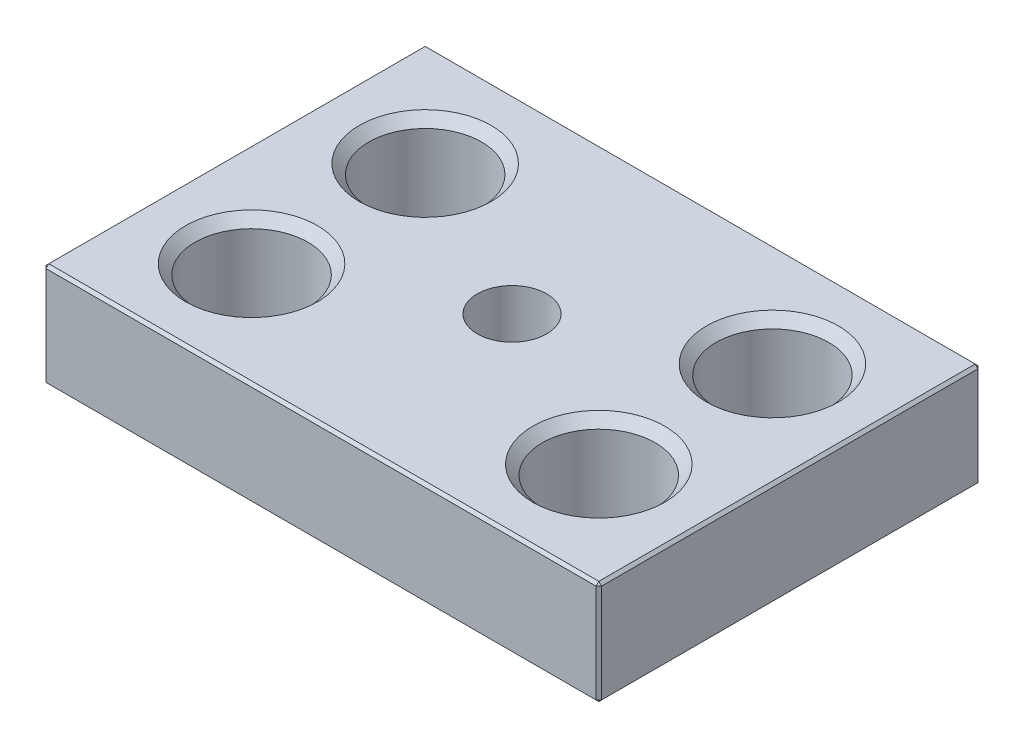
ISO-10303-21;
HEADER;
FILE_DESCRIPTION(('STEP AP214'),'2;1');
FILE_NAME('part.step','',(''),(''),'','','');
FILE_SCHEMA(('AUTOMOTIVE_DESIGN { 1 0 10303 214 1 1 1 1 }'));
ENDSEC;
DATA;
#1=APPLICATION_CONTEXT('core data for automotive mechanical design processes');
#2=APPLICATION_PROTOCOL_DEFINITION('international standard','automotive_design',2000,#1);
#3=PRODUCT_CONTEXT('',#1,'mechanical');
#4=PRODUCT('Part','Part','',(#3));
#5=PRODUCT_RELATED_PRODUCT_CATEGORY('part','',(#4));
#6=PRODUCT_DEFINITION_FORMATION('','',#4);
#7=PRODUCT_DEFINITION_CONTEXT('part definition',#1,'design');
#8=PRODUCT_DEFINITION('design','',#6,#7);
#9=PRODUCT_DEFINITION_SHAPE('','',#8);
#10=(LENGTH_UNIT() NAMED_UNIT(*) SI_UNIT(.MILLI.,.METRE.));
#11=(NAMED_UNIT(*) PLANE_ANGLE_UNIT() SI_UNIT($,.RADIAN.));
#12=(NAMED_UNIT(*) SI_UNIT($,.STERADIAN.) SOLID_ANGLE_UNIT());
#13=UNCERTAINTY_MEASURE_WITH_UNIT(LENGTH_MEASURE(1.E-05),#10,'distance_accuracy_value','');
#14=(GEOMETRIC_REPRESENTATION_CONTEXT(3) GLOBAL_UNCERTAINTY_ASSIGNED_CONTEXT((#13)) GLOBAL_UNIT_ASSIGNED_CONTEXT((#10,
#11,#12)) REPRESENTATION_CONTEXT('',''));
#15=CARTESIAN_POINT('',(0.,0.,0.));
#16=DIRECTION('',(0.,0.,1.));
#17=DIRECTION('',(1.,0.,0.));
#18=AXIS2_PLACEMENT_3D('',#15,#16,#17);
#19=CARTESIAN_POINT('',(-50.8,19.05,-34.925));
#20=DIRECTION('',(1.,0.,0.));
#21=DIRECTION('',(0.,0.,-1.));
#22=AXIS2_PLACEMENT_3D('',#19,#20,#21);
#23=PLANE('',#22);
#24=DIRECTION('',(0.,0.,1.));
#25=VECTOR('',#24,1.);
#26=CARTESIAN_POINT('',(-50.8,0.508000000000008,-34.925));
#27=LINE('',#26,#25);
#28=CARTESIAN_POINT('',(-50.8,0.508000000000008,-34.417));
#29=VERTEX_POINT('',#28);
#30=CARTESIAN_POINT('',(-50.8,0.508000000000008,34.417));
#31=VERTEX_POINT('',#30);
#32=EDGE_CURVE('E275',#29,#31,#27,.T.);
#33=ORIENTED_EDGE('',*,*,#32,.T.);
#34=DIRECTION('',(0.,1.,0.));
#35=VECTOR('',#34,1.);
#36=CARTESIAN_POINT('',(-50.8,19.05,34.417));
#37=LINE('',#36,#35);
#38=CARTESIAN_POINT('',(-50.8,18.542,34.417));
#39=VERTEX_POINT('',#38);
#40=EDGE_CURVE('E277',#31,#39,#37,.T.);
#41=ORIENTED_EDGE('',*,*,#40,.T.);
#42=DIRECTION('',(0.,0.,-1.));
#43=VECTOR('',#42,1.);
#44=CARTESIAN_POINT('',(-50.8,18.542,-34.925));
#45=LINE('',#44,#43);
#46=CARTESIAN_POINT('',(-50.8,18.542,-34.417));
#47=VERTEX_POINT('',#46);
#48=EDGE_CURVE('E271',#39,#47,#45,.T.);
#49=ORIENTED_EDGE('',*,*,#48,.T.);
#50=DIRECTION('',(0.,-1.,0.));
#51=VECTOR('',#50,1.);
#52=CARTESIAN_POINT('',(-50.8,19.05,-34.417));
#53=LINE('',#52,#51);
#54=EDGE_CURVE('E273',#47,#29,#53,.T.);
#55=ORIENTED_EDGE('',*,*,#54,.T.);
#56=EDGE_LOOP('',(#33,#41,#49,#55));
#57=FACE_BOUND('',#56,.T.);
#58=ADVANCED_FACE('F34',(#57),#23,.F.);
#59=CARTESIAN_POINT('',(-50.8,19.05,34.925));
#60=DIRECTION('',(0.,0.,-1.));
#61=DIRECTION('',(-1.,0.,0.));
#62=AXIS2_PLACEMENT_3D('',#59,#60,#61);
#63=PLANE('',#62);
#64=DIRECTION('',(-1.,0.,0.));
#65=VECTOR('',#64,1.);
#66=CARTESIAN_POINT('',(-50.8,18.542,34.925));
#67=LINE('',#66,#65);
#68=CARTESIAN_POINT('',(50.292,18.542,34.925));
#69=VERTEX_POINT('',#68);
#70=CARTESIAN_POINT('',(-50.292,18.542,34.925));
#71=VERTEX_POINT('',#70);
#72=EDGE_CURVE('E133',#69,#71,#67,.T.);
#73=ORIENTED_EDGE('',*,*,#72,.T.);
#74=DIRECTION('',(0.,-1.,0.));
#75=VECTOR('',#74,1.);
#76=CARTESIAN_POINT('',(-50.292,19.05,34.925));
#77=LINE('',#76,#75);
#78=CARTESIAN_POINT('',(-50.292,0.508000000000008,34.925));
#79=VERTEX_POINT('',#78);
#80=EDGE_CURVE('E129',#71,#79,#77,.T.);
#81=ORIENTED_EDGE('',*,*,#80,.T.);
#82=DIRECTION('',(1.,0.,0.));
#83=VECTOR('',#82,1.);
#84=CARTESIAN_POINT('',(-50.8,0.508000000000008,34.925));
#85=LINE('',#84,#83);
#86=CARTESIAN_POINT('',(50.292,0.508000000000008,34.925));
#87=VERTEX_POINT('',#86);
#88=EDGE_CURVE('E123',#79,#87,#85,.T.);
#89=ORIENTED_EDGE('',*,*,#88,.T.);
#90=DIRECTION('',(0.,1.,0.));
#91=VECTOR('',#90,1.);
#92=CARTESIAN_POINT('',(50.292,19.05,34.925));
#93=LINE('',#92,#91);
#94=EDGE_CURVE('E126',#87,#69,#93,.T.);
#95=ORIENTED_EDGE('',*,*,#94,.T.);
#96=EDGE_LOOP('',(#73,#81,#89,#95));
#97=FACE_BOUND('',#96,.T.);
#98=ADVANCED_FACE('F125',(#97),#63,.F.);
#99=CARTESIAN_POINT('',(50.8,19.05,-34.925));
#100=DIRECTION('',(-1.,0.,0.));
#101=DIRECTION('',(0.,0.,1.));
#102=AXIS2_PLACEMENT_3D('',#99,#100,#101);
#103=PLANE('',#102);
#104=DIRECTION('',(0.,0.,1.));
#105=VECTOR('',#104,1.);
#106=CARTESIAN_POINT('',(50.8,18.542,34.925));
#107=LINE('',#106,#105);
#108=CARTESIAN_POINT('',(50.8,18.542,-34.417));
#109=VERTEX_POINT('',#108);
#110=CARTESIAN_POINT('',(50.8,18.542,34.417));
#111=VERTEX_POINT('',#110);
#112=EDGE_CURVE('E43',#109,#111,#107,.T.);
#113=ORIENTED_EDGE('',*,*,#112,.T.);
#114=DIRECTION('',(0.,-1.,0.));
#115=VECTOR('',#114,1.);
#116=CARTESIAN_POINT('',(50.8,19.05,34.417));
#117=LINE('',#116,#115);
#118=CARTESIAN_POINT('',(50.8,0.508000000000008,34.417));
#119=VERTEX_POINT('',#118);
#120=EDGE_CURVE('E11',#111,#119,#117,.T.);
#121=ORIENTED_EDGE('',*,*,#120,.T.);
#122=DIRECTION('',(0.,0.,-1.));
#123=VECTOR('',#122,1.);
#124=CARTESIAN_POINT('',(50.8,0.508000000000008,-34.925));
#125=LINE('',#124,#123);
#126=CARTESIAN_POINT('',(50.8,0.508000000000008,-34.417));
#127=VERTEX_POINT('',#126);
#128=EDGE_CURVE('E305',#119,#127,#125,.T.);
#129=ORIENTED_EDGE('',*,*,#128,.T.);
#130=DIRECTION('',(0.,1.,0.));
#131=VECTOR('',#130,1.);
#132=CARTESIAN_POINT('',(50.8,19.05,-34.417));
#133=LINE('',#132,#131);
#134=EDGE_CURVE('E54',#127,#109,#133,.T.);
#135=ORIENTED_EDGE('',*,*,#134,.T.);
#136=EDGE_LOOP('',(#113,#121,#129,#135));
#137=FACE_BOUND('',#136,.T.);
#138=ADVANCED_FACE('F352',(#137),#103,.F.);
#139=CARTESIAN_POINT('',(-50.8,19.05,-34.925));
#140=DIRECTION('',(0.,0.,1.));
#141=DIRECTION('',(1.,0.,0.));
#142=AXIS2_PLACEMENT_3D('',#139,#140,#141);
#143=PLANE('',#142);
#144=DIRECTION('',(-1.,0.,0.));
#145=VECTOR('',#144,1.);
#146=CARTESIAN_POINT('',(-50.8,0.508000000000008,-34.925));
#147=LINE('',#146,#145);
#148=CARTESIAN_POINT('',(50.292,0.508000000000008,-34.925));
#149=VERTEX_POINT('',#148);
#150=CARTESIAN_POINT('',(-50.292,0.508000000000008,-34.925));
#151=VERTEX_POINT('',#150);
#152=EDGE_CURVE('E287',#149,#151,#147,.T.);
#153=ORIENTED_EDGE('',*,*,#152,.T.);
#154=DIRECTION('',(0.,1.,0.));
#155=VECTOR('',#154,1.);
#156=CARTESIAN_POINT('',(-50.292,19.05,-34.925));
#157=LINE('',#156,#155);
#158=CARTESIAN_POINT('',(-50.292,18.542,-34.925));
#159=VERTEX_POINT('',#158);
#160=EDGE_CURVE('E293',#151,#159,#157,.T.);
#161=ORIENTED_EDGE('',*,*,#160,.T.);
#162=DIRECTION('',(1.,0.,0.));
#163=VECTOR('',#162,1.);
#164=CARTESIAN_POINT('',(50.8,18.542,-34.925));
#165=LINE('',#164,#163);
#166=CARTESIAN_POINT('',(50.292,18.542,-34.925));
#167=VERTEX_POINT('',#166);
#168=EDGE_CURVE('E291',#159,#167,#165,.T.);
#169=ORIENTED_EDGE('',*,*,#168,.T.);
#170=DIRECTION('',(0.,-1.,0.));
#171=VECTOR('',#170,1.);
#172=CARTESIAN_POINT('',(50.292,19.05,-34.925));
#173=LINE('',#172,#171);
#174=EDGE_CURVE('E289',#167,#149,#173,.T.);
#175=ORIENTED_EDGE('',*,*,#174,.T.);
#176=EDGE_LOOP('',(#153,#161,#169,#175));
#177=FACE_BOUND('',#176,.T.);
#178=ADVANCED_FACE('F697',(#177),#143,.F.);
#179=CARTESIAN_POINT('',(-50.8,19.05,34.925));
#180=DIRECTION('',(0.,1.,0.));
#181=DIRECTION('',(0.,0.,1.));
#182=AXIS2_PLACEMENT_3D('',#179,#180,#181);
#183=PLANE('',#182);
#184=DIRECTION('',(-1.,0.,0.));
#185=VECTOR('',#184,1.);
#186=CARTESIAN_POINT('',(-50.8,19.05,-34.417));
#187=LINE('',#186,#185);
#188=CARTESIAN_POINT('',(50.292,19.05,-34.417));
#189=VERTEX_POINT('',#188);
#190=CARTESIAN_POINT('',(-50.292,19.05,-34.417));
#191=VERTEX_POINT('',#190);
#192=EDGE_CURVE('E298',#189,#191,#187,.T.);
#193=ORIENTED_EDGE('',*,*,#192,.T.);
#194=DIRECTION('',(0.,0.,1.));
#195=VECTOR('',#194,1.);
#196=CARTESIAN_POINT('',(-50.292,19.05,34.925));
#197=LINE('',#196,#195);
#198=CARTESIAN_POINT('',(-50.292,19.05,34.417));
#199=VERTEX_POINT('',#198);
#200=EDGE_CURVE('E302',#191,#199,#197,.T.);
#201=ORIENTED_EDGE('',*,*,#200,.T.);
#202=DIRECTION('',(1.,0.,0.));
#203=VECTOR('',#202,1.);
#204=CARTESIAN_POINT('',(50.8,19.05,34.417));
#205=LINE('',#204,#203);
#206=CARTESIAN_POINT('',(50.292,19.05,34.417));
#207=VERTEX_POINT('',#206);
#208=EDGE_CURVE('E300',#199,#207,#205,.T.);
#209=ORIENTED_EDGE('',*,*,#208,.T.);
#210=DIRECTION('',(0.,0.,-1.));
#211=VECTOR('',#210,1.);
#212=CARTESIAN_POINT('',(50.292,19.05,-34.925));
#213=LINE('',#212,#211);
#214=EDGE_CURVE('E296',#207,#189,#213,.T.);
#215=ORIENTED_EDGE('',*,*,#214,.T.);
#216=EDGE_LOOP('',(#193,#201,#209,#215));
#217=FACE_BOUND('',#216,.T.);
#218=CARTESIAN_POINT('',(0.,19.05,0.));
#219=DIRECTION('',(0.,1.,0.));
#220=DIRECTION('',(0.,0.,1.));
#221=AXIS2_PLACEMENT_3D('',#218,#219,#220);
#222=CIRCLE('',#221,6.35);
#223=CARTESIAN_POINT('',(0.,19.05,6.35));
#224=VERTEX_POINT('',#223);
#225=EDGE_CURVE('E204',#224,#224,#222,.T.);
#226=ORIENTED_EDGE('',*,*,#225,.F.);
#227=EDGE_LOOP('',(#226));
#228=FACE_BOUND('',#227,.T.);
#229=CARTESIAN_POINT('',(31.75,19.05,15.875));
#230=DIRECTION('',(0.,1.,0.));
#231=DIRECTION('',(0.,0.,1.));
#232=AXIS2_PLACEMENT_3D('',#229,#230,#231);
#233=CIRCLE('',#232,12.065);
#234=CARTESIAN_POINT('',(31.75,19.05,27.94));
#235=VERTEX_POINT('',#234);
#236=EDGE_CURVE('E222',#235,#235,#233,.T.);
#237=ORIENTED_EDGE('',*,*,#236,.F.);
#238=EDGE_LOOP('',(#237));
#239=FACE_BOUND('',#238,.T.);
#240=CARTESIAN_POINT('',(31.75,19.05,-15.875));
#241=DIRECTION('',(0.,1.,0.));
#242=DIRECTION('',(0.,0.,1.));
#243=AXIS2_PLACEMENT_3D('',#240,#241,#242);
#244=CIRCLE('',#243,12.065);
#245=CARTESIAN_POINT('',(31.75,19.05,-3.81));
#246=VERTEX_POINT('',#245);
#247=EDGE_CURVE('E234',#246,#246,#244,.T.);
#248=ORIENTED_EDGE('',*,*,#247,.F.);
#249=EDGE_LOOP('',(#248));
#250=FACE_BOUND('',#249,.T.);
#251=CARTESIAN_POINT('',(-31.75,19.05,-15.875));
#252=DIRECTION('',(0.,1.,0.));
#253=DIRECTION('',(0.,0.,1.));
#254=AXIS2_PLACEMENT_3D('',#251,#252,#253);
#255=CIRCLE('',#254,12.065);
#256=CARTESIAN_POINT('',(-31.75,19.05,-3.81));
#257=VERTEX_POINT('',#256);
#258=EDGE_CURVE('E246',#257,#257,#255,.T.);
#259=ORIENTED_EDGE('',*,*,#258,.F.);
#260=EDGE_LOOP('',(#259));
#261=FACE_BOUND('',#260,.T.);
#262=CARTESIAN_POINT('',(-31.75,19.05,15.875));
#263=DIRECTION('',(0.,1.,0.));
#264=DIRECTION('',(0.,0.,1.));
#265=AXIS2_PLACEMENT_3D('',#262,#263,#264);
#266=CIRCLE('',#265,12.065);
#267=CARTESIAN_POINT('',(-31.75,19.05,27.94));
#268=VERTEX_POINT('',#267);
#269=EDGE_CURVE('E258',#268,#268,#266,.T.);
#270=ORIENTED_EDGE('',*,*,#269,.F.);
#271=EDGE_LOOP('',(#270));
#272=FACE_BOUND('',#271,.T.);
#273=ADVANCED_FACE('F363',(#217,#228,#239,#250,#261,#272),#183,.T.);
#274=CARTESIAN_POINT('',(-50.8,0.,34.925));
#275=DIRECTION('',(0.,1.,0.));
#276=DIRECTION('',(0.,0.,1.));
#277=AXIS2_PLACEMENT_3D('',#274,#275,#276);
#278=PLANE('',#277);
#279=DIRECTION('',(0.,0.,1.));
#280=VECTOR('',#279,1.);
#281=CARTESIAN_POINT('',(50.292,0.,34.925));
#282=LINE('',#281,#280);
#283=CARTESIAN_POINT('',(50.292,0.,-34.417));
#284=VERTEX_POINT('',#283);
#285=CARTESIAN_POINT('',(50.292,0.,34.417));
#286=VERTEX_POINT('',#285);
#287=EDGE_CURVE('E282',#284,#286,#282,.T.);
#288=ORIENTED_EDGE('',*,*,#287,.T.);
#289=DIRECTION('',(-1.,0.,0.));
#290=VECTOR('',#289,1.);
#291=CARTESIAN_POINT('',(-50.8,0.,34.417));
#292=LINE('',#291,#290);
#293=CARTESIAN_POINT('',(-50.292,0.,34.417));
#294=VERTEX_POINT('',#293);
#295=EDGE_CURVE('E156',#286,#294,#292,.T.);
#296=ORIENTED_EDGE('',*,*,#295,.T.);
#297=DIRECTION('',(0.,0.,-1.));
#298=VECTOR('',#297,1.);
#299=CARTESIAN_POINT('',(-50.292,0.,34.925));
#300=LINE('',#299,#298);
#301=CARTESIAN_POINT('',(-50.292,0.,-34.417));
#302=VERTEX_POINT('',#301);
#303=EDGE_CURVE('E284',#294,#302,#300,.T.);
#304=ORIENTED_EDGE('',*,*,#303,.T.);
#305=DIRECTION('',(1.,0.,0.));
#306=VECTOR('',#305,1.);
#307=CARTESIAN_POINT('',(-50.8,0.,-34.417));
#308=LINE('',#307,#306);
#309=EDGE_CURVE('E280',#302,#284,#308,.T.);
#310=ORIENTED_EDGE('',*,*,#309,.T.);
#311=EDGE_LOOP('',(#288,#296,#304,#310));
#312=FACE_BOUND('',#311,.T.);
#313=CARTESIAN_POINT('',(0.,0.,0.));
#314=DIRECTION('',(0.,1.,0.));
#315=DIRECTION('',(0.,0.,1.));
#316=AXIS2_PLACEMENT_3D('',#313,#314,#315);
#317=CIRCLE('',#316,2.8067);
#318=CARTESIAN_POINT('',(0.,0.,2.8067));
#319=VERTEX_POINT('',#318);
#320=EDGE_CURVE('E219',#319,#319,#317,.T.);
#321=ORIENTED_EDGE('',*,*,#320,.T.);
#322=EDGE_LOOP('',(#321));
#323=FACE_BOUND('',#322,.T.);
#324=CARTESIAN_POINT('',(31.75,0.,15.875));
#325=DIRECTION('',(0.,1.,0.));
#326=DIRECTION('',(0.,0.,1.));
#327=AXIS2_PLACEMENT_3D('',#324,#325,#326);
#328=CIRCLE('',#327,12.065);
#329=CARTESIAN_POINT('',(31.75,0.,27.94));
#330=VERTEX_POINT('',#329);
#331=EDGE_CURVE('E231',#330,#330,#328,.T.);
#332=ORIENTED_EDGE('',*,*,#331,.T.);
#333=EDGE_LOOP('',(#332));
#334=FACE_BOUND('',#333,.T.);
#335=CARTESIAN_POINT('',(31.75,0.,-15.875));
#336=DIRECTION('',(0.,1.,0.));
#337=DIRECTION('',(0.,0.,1.));
#338=AXIS2_PLACEMENT_3D('',#335,#336,#337);
#339=CIRCLE('',#338,12.065);
#340=CARTESIAN_POINT('',(31.75,0.,-3.81000000000001));
#341=VERTEX_POINT('',#340);
#342=EDGE_CURVE('E243',#341,#341,#339,.T.);
#343=ORIENTED_EDGE('',*,*,#342,.T.);
#344=EDGE_LOOP('',(#343));
#345=FACE_BOUND('',#344,.T.);
#346=CARTESIAN_POINT('',(-31.75,0.,-15.875));
#347=DIRECTION('',(0.,1.,0.));
#348=DIRECTION('',(0.,0.,1.));
#349=AXIS2_PLACEMENT_3D('',#346,#347,#348);
#350=CIRCLE('',#349,12.065);
#351=CARTESIAN_POINT('',(-31.75,0.,-3.81000000000001));
#352=VERTEX_POINT('',#351);
#353=EDGE_CURVE('E255',#352,#352,#350,.T.);
#354=ORIENTED_EDGE('',*,*,#353,.T.);
#355=EDGE_LOOP('',(#354));
#356=FACE_BOUND('',#355,.T.);
#357=CARTESIAN_POINT('',(-31.75,0.,15.875));
#358=DIRECTION('',(0.,1.,0.));
#359=DIRECTION('',(0.,0.,1.));
#360=AXIS2_PLACEMENT_3D('',#357,#358,#359);
#361=CIRCLE('',#360,12.065);
#362=CARTESIAN_POINT('',(-31.75,0.,27.94));
#363=VERTEX_POINT('',#362);
#364=EDGE_CURVE('E144',#363,#363,#361,.T.);
#365=ORIENTED_EDGE('',*,*,#364,.T.);
#366=EDGE_LOOP('',(#365));
#367=FACE_BOUND('',#366,.T.);
#368=ADVANCED_FACE('F347',(#312,#323,#334,#345,#356,#367),#278,.F.);
#369=CARTESIAN_POINT('',(-31.75,1.74625,15.875));
#370=DIRECTION('',(0.,-1.,0.));
#371=DIRECTION('',(0.,0.,-1.));
#372=AXIS2_PLACEMENT_3D('',#369,#370,#371);
#373=CONICAL_SURFACE('',#372,10.31875,0.785398163397447);
#374=ORIENTED_EDGE('',*,*,#364,.F.);
#375=EDGE_LOOP('',(#374));
#376=FACE_BOUND('',#375,.T.);
#377=CARTESIAN_POINT('',(-31.75,1.74625,15.875));
#378=DIRECTION('',(0.,1.,0.));
#379=DIRECTION('',(0.,0.,1.));
#380=AXIS2_PLACEMENT_3D('',#377,#378,#379);
#381=CIRCLE('',#380,10.31875);
#382=CARTESIAN_POINT('',(-31.75,1.74625,26.19375));
#383=VERTEX_POINT('',#382);
#384=EDGE_CURVE('E264',#383,#383,#381,.T.);
#385=ORIENTED_EDGE('',*,*,#384,.T.);
#386=EDGE_LOOP('',(#385));
#387=FACE_BOUND('',#386,.T.);
#388=ADVANCED_FACE('F673',(#376,#387),#373,.F.);
#389=CARTESIAN_POINT('',(-31.75,19.05,15.875));
#390=DIRECTION('',(0.,1.,0.));
#391=DIRECTION('',(0.,0.,1.));
#392=AXIS2_PLACEMENT_3D('',#389,#390,#391);
#393=CYLINDRICAL_SURFACE('',#392,10.31875);
#394=ORIENTED_EDGE('',*,*,#384,.F.);
#395=EDGE_LOOP('',(#394));
#396=FACE_BOUND('',#395,.T.);
#397=CARTESIAN_POINT('',(-31.75,17.30375,15.875));
#398=DIRECTION('',(0.,1.,0.));
#399=DIRECTION('',(0.,0.,1.));
#400=AXIS2_PLACEMENT_3D('',#397,#398,#399);
#401=CIRCLE('',#400,10.31875);
#402=CARTESIAN_POINT('',(-31.75,17.30375,26.19375));
#403=VERTEX_POINT('',#402);
#404=EDGE_CURVE('E261',#403,#403,#401,.T.);
#405=ORIENTED_EDGE('',*,*,#404,.T.);
#406=EDGE_LOOP('',(#405));
#407=FACE_BOUND('',#406,.T.);
#408=ADVANCED_FACE('F664',(#396,#407),#393,.F.);
#409=CARTESIAN_POINT('',(-31.75,19.05,15.875));
#410=DIRECTION('',(0.,1.,0.));
#411=DIRECTION('',(0.,0.,1.));
#412=AXIS2_PLACEMENT_3D('',#409,#410,#411);
#413=CONICAL_SURFACE('',#412,12.065,0.785398163397448);
#414=ORIENTED_EDGE('',*,*,#404,.F.);
#415=EDGE_LOOP('',(#414));
#416=FACE_BOUND('',#415,.T.);
#417=ORIENTED_EDGE('',*,*,#269,.T.);
#418=EDGE_LOOP('',(#417));
#419=FACE_BOUND('',#418,.T.);
#420=ADVANCED_FACE('F655',(#416,#419),#413,.F.);
#421=CARTESIAN_POINT('',(-31.75,1.74625,-15.875));
#422=DIRECTION('',(0.,-1.,0.));
#423=DIRECTION('',(0.,0.,-1.));
#424=AXIS2_PLACEMENT_3D('',#421,#422,#423);
#425=CONICAL_SURFACE('',#424,10.31875,0.785398163397447);
#426=ORIENTED_EDGE('',*,*,#353,.F.);
#427=EDGE_LOOP('',(#426));
#428=FACE_BOUND('',#427,.T.);
#429=CARTESIAN_POINT('',(-31.75,1.74625,-15.875));
#430=DIRECTION('',(0.,1.,0.));
#431=DIRECTION('',(0.,0.,1.));
#432=AXIS2_PLACEMENT_3D('',#429,#430,#431);
#433=CIRCLE('',#432,10.31875);
#434=CARTESIAN_POINT('',(-31.75,1.74625,-5.55625000000001));
#435=VERTEX_POINT('',#434);
#436=EDGE_CURVE('E252',#435,#435,#433,.T.);
#437=ORIENTED_EDGE('',*,*,#436,.T.);
#438=EDGE_LOOP('',(#437));
#439=FACE_BOUND('',#438,.T.);
#440=ADVANCED_FACE('F646',(#428,#439),#425,.F.);
#441=CARTESIAN_POINT('',(-31.75,19.05,-15.875));
#442=DIRECTION('',(0.,1.,0.));
#443=DIRECTION('',(0.,0.,1.));
#444=AXIS2_PLACEMENT_3D('',#441,#442,#443);
#445=CYLINDRICAL_SURFACE('',#444,10.31875);
#446=ORIENTED_EDGE('',*,*,#436,.F.);
#447=EDGE_LOOP('',(#446));
#448=FACE_BOUND('',#447,.T.);
#449=CARTESIAN_POINT('',(-31.75,17.30375,-15.875));
#450=DIRECTION('',(0.,1.,0.));
#451=DIRECTION('',(0.,0.,1.));
#452=AXIS2_PLACEMENT_3D('',#449,#450,#451);
#453=CIRCLE('',#452,10.31875);
#454=CARTESIAN_POINT('',(-31.75,17.30375,-5.55625));
#455=VERTEX_POINT('',#454);
#456=EDGE_CURVE('E249',#455,#455,#453,.T.);
#457=ORIENTED_EDGE('',*,*,#456,.T.);
#458=EDGE_LOOP('',(#457));
#459=FACE_BOUND('',#458,.T.);
#460=ADVANCED_FACE('F637',(#448,#459),#445,.F.);
#461=CARTESIAN_POINT('',(-31.75,19.05,-15.875));
#462=DIRECTION('',(0.,1.,0.));
#463=DIRECTION('',(0.,0.,1.));
#464=AXIS2_PLACEMENT_3D('',#461,#462,#463);
#465=CONICAL_SURFACE('',#464,12.065,0.785398163397448);
#466=ORIENTED_EDGE('',*,*,#456,.F.);
#467=EDGE_LOOP('',(#466));
#468=FACE_BOUND('',#467,.T.);
#469=ORIENTED_EDGE('',*,*,#258,.T.);
#470=EDGE_LOOP('',(#469));
#471=FACE_BOUND('',#470,.T.);
#472=ADVANCED_FACE('F628',(#468,#471),#465,.F.);
#473=CARTESIAN_POINT('',(31.75,1.74625,-15.875));
#474=DIRECTION('',(0.,-1.,0.));
#475=DIRECTION('',(0.,0.,-1.));
#476=AXIS2_PLACEMENT_3D('',#473,#474,#475);
#477=CONICAL_SURFACE('',#476,10.31875,0.785398163397447);
#478=ORIENTED_EDGE('',*,*,#342,.F.);
#479=EDGE_LOOP('',(#478));
#480=FACE_BOUND('',#479,.T.);
#481=CARTESIAN_POINT('',(31.75,1.74625,-15.875));
#482=DIRECTION('',(0.,1.,0.));
#483=DIRECTION('',(0.,0.,1.));
#484=AXIS2_PLACEMENT_3D('',#481,#482,#483);
#485=CIRCLE('',#484,10.31875);
#486=CARTESIAN_POINT('',(31.75,1.74625,-5.55625000000001));
#487=VERTEX_POINT('',#486);
#488=EDGE_CURVE('E240',#487,#487,#485,.T.);
#489=ORIENTED_EDGE('',*,*,#488,.T.);
#490=EDGE_LOOP('',(#489));
#491=FACE_BOUND('',#490,.T.);
#492=ADVANCED_FACE('F619',(#480,#491),#477,.F.);
#493=CARTESIAN_POINT('',(31.75,19.05,-15.875));
#494=DIRECTION('',(0.,1.,0.));
#495=DIRECTION('',(0.,0.,1.));
#496=AXIS2_PLACEMENT_3D('',#493,#494,#495);
#497=CYLINDRICAL_SURFACE('',#496,10.31875);
#498=ORIENTED_EDGE('',*,*,#488,.F.);
#499=EDGE_LOOP('',(#498));
#500=FACE_BOUND('',#499,.T.);
#501=CARTESIAN_POINT('',(31.75,17.30375,-15.875));
#502=DIRECTION('',(0.,1.,0.));
#503=DIRECTION('',(0.,0.,1.));
#504=AXIS2_PLACEMENT_3D('',#501,#502,#503);
#505=CIRCLE('',#504,10.31875);
#506=CARTESIAN_POINT('',(31.75,17.30375,-5.55625));
#507=VERTEX_POINT('',#506);
#508=EDGE_CURVE('E237',#507,#507,#505,.T.);
#509=ORIENTED_EDGE('',*,*,#508,.T.);
#510=EDGE_LOOP('',(#509));
#511=FACE_BOUND('',#510,.T.);
#512=ADVANCED_FACE('F610',(#500,#511),#497,.F.);
#513=CARTESIAN_POINT('',(31.75,19.05,-15.875));
#514=DIRECTION('',(0.,1.,0.));
#515=DIRECTION('',(0.,0.,1.));
#516=AXIS2_PLACEMENT_3D('',#513,#514,#515);
#517=CONICAL_SURFACE('',#516,12.065,0.785398163397447);
#518=ORIENTED_EDGE('',*,*,#508,.F.);
#519=EDGE_LOOP('',(#518));
#520=FACE_BOUND('',#519,.T.);
#521=ORIENTED_EDGE('',*,*,#247,.T.);
#522=EDGE_LOOP('',(#521));
#523=FACE_BOUND('',#522,.T.);
#524=ADVANCED_FACE('F601',(#520,#523),#517,.F.);
#525=CARTESIAN_POINT('',(31.75,1.74625,15.875));
#526=DIRECTION('',(0.,-1.,0.));
#527=DIRECTION('',(0.,0.,-1.));
#528=AXIS2_PLACEMENT_3D('',#525,#526,#527);
#529=CONICAL_SURFACE('',#528,10.31875,0.785398163397447);
#530=ORIENTED_EDGE('',*,*,#331,.F.);
#531=EDGE_LOOP('',(#530));
#532=FACE_BOUND('',#531,.T.);
#533=CARTESIAN_POINT('',(31.75,1.74625,15.875));
#534=DIRECTION('',(0.,1.,0.));
#535=DIRECTION('',(0.,0.,1.));
#536=AXIS2_PLACEMENT_3D('',#533,#534,#535);
#537=CIRCLE('',#536,10.31875);
#538=CARTESIAN_POINT('',(31.75,1.74625,26.19375));
#539=VERTEX_POINT('',#538);
#540=EDGE_CURVE('E228',#539,#539,#537,.T.);
#541=ORIENTED_EDGE('',*,*,#540,.T.);
#542=EDGE_LOOP('',(#541));
#543=FACE_BOUND('',#542,.T.);
#544=ADVANCED_FACE('F592',(#532,#543),#529,.F.);
#545=CARTESIAN_POINT('',(31.75,19.05,15.875));
#546=DIRECTION('',(0.,1.,0.));
#547=DIRECTION('',(0.,0.,1.));
#548=AXIS2_PLACEMENT_3D('',#545,#546,#547);
#549=CYLINDRICAL_SURFACE('',#548,10.31875);
#550=ORIENTED_EDGE('',*,*,#540,.F.);
#551=EDGE_LOOP('',(#550));
#552=FACE_BOUND('',#551,.T.);
#553=CARTESIAN_POINT('',(31.75,17.30375,15.875));
#554=DIRECTION('',(0.,1.,0.));
#555=DIRECTION('',(0.,0.,1.));
#556=AXIS2_PLACEMENT_3D('',#553,#554,#555);
#557=CIRCLE('',#556,10.31875);
#558=CARTESIAN_POINT('',(31.75,17.30375,26.19375));
#559=VERTEX_POINT('',#558);
#560=EDGE_CURVE('E225',#559,#559,#557,.T.);
#561=ORIENTED_EDGE('',*,*,#560,.T.);
#562=EDGE_LOOP('',(#561));
#563=FACE_BOUND('',#562,.T.);
#564=ADVANCED_FACE('F583',(#552,#563),#549,.F.);
#565=CARTESIAN_POINT('',(31.75,19.05,15.875));
#566=DIRECTION('',(0.,1.,0.));
#567=DIRECTION('',(0.,0.,1.));
#568=AXIS2_PLACEMENT_3D('',#565,#566,#567);
#569=CONICAL_SURFACE('',#568,12.065,0.785398163397447);
#570=ORIENTED_EDGE('',*,*,#560,.F.);
#571=EDGE_LOOP('',(#570));
#572=FACE_BOUND('',#571,.T.);
#573=ORIENTED_EDGE('',*,*,#236,.T.);
#574=EDGE_LOOP('',(#573));
#575=FACE_BOUND('',#574,.T.);
#576=ADVANCED_FACE('F574',(#572,#575),#569,.F.);
#577=CARTESIAN_POINT('',(0.,19.05,0.));
#578=DIRECTION('',(0.,1.,0.));
#579=DIRECTION('',(0.,0.,1.));
#580=AXIS2_PLACEMENT_3D('',#577,#578,#579);
#581=CYLINDRICAL_SURFACE('',#580,2.8067);
#582=ORIENTED_EDGE('',*,*,#320,.F.);
#583=EDGE_LOOP('',(#582));
#584=FACE_BOUND('',#583,.T.);
#585=CARTESIAN_POINT('',(0.,3.81000000000001,0.));
#586=DIRECTION('',(0.,1.,0.));
#587=DIRECTION('',(0.,0.,1.));
#588=AXIS2_PLACEMENT_3D('',#585,#586,#587);
#589=CIRCLE('',#588,2.8067);
#590=CARTESIAN_POINT('',(0.,3.81000000000001,2.8067));
#591=VERTEX_POINT('',#590);
#592=EDGE_CURVE('E214',#591,#591,#589,.T.);
#593=ORIENTED_EDGE('',*,*,#592,.T.);
#594=EDGE_LOOP('',(#593));
#595=FACE_BOUND('',#594,.T.);
#596=ADVANCED_FACE('F565',(#584,#595),#581,.F.);
#597=CARTESIAN_POINT('',(2.8067,3.81000000000001,0.));
#598=DIRECTION('',(0.,-1.,0.));
#599=DIRECTION('',(0.,0.,-1.));
#600=AXIS2_PLACEMENT_3D('',#597,#598,#599);
#601=PLANE('',#600);
#602=ORIENTED_EDGE('',*,*,#592,.F.);
#603=EDGE_LOOP('',(#602));
#604=FACE_BOUND('',#603,.T.);
#605=CARTESIAN_POINT('',(0.,3.81000000000001,0.));
#606=DIRECTION('',(0.,1.,0.));
#607=DIRECTION('',(0.,0.,1.));
#608=AXIS2_PLACEMENT_3D('',#605,#606,#607);
#609=CIRCLE('',#608,6.35);
#610=CARTESIAN_POINT('',(0.,3.81000000000001,6.35));
#611=VERTEX_POINT('',#610);
#612=EDGE_CURVE('E209',#611,#611,#609,.T.);
#613=ORIENTED_EDGE('',*,*,#612,.T.);
#614=EDGE_LOOP('',(#613));
#615=FACE_BOUND('',#614,.T.);
#616=ADVANCED_FACE('F556',(#604,#615),#601,.F.);
#617=CARTESIAN_POINT('',(0.,19.05,0.));
#618=DIRECTION('',(0.,1.,0.));
#619=DIRECTION('',(0.,0.,1.));
#620=AXIS2_PLACEMENT_3D('',#617,#618,#619);
#621=CYLINDRICAL_SURFACE('',#620,6.35);
#622=ORIENTED_EDGE('',*,*,#612,.F.);
#623=EDGE_LOOP('',(#622));
#624=FACE_BOUND('',#623,.T.);
#625=ORIENTED_EDGE('',*,*,#225,.T.);
#626=EDGE_LOOP('',(#625));
#627=FACE_BOUND('',#626,.T.);
#628=ADVANCED_FACE('F548',(#624,#627),#621,.F.);
#629=CARTESIAN_POINT('',(50.292,19.05,-34.925));
#630=DIRECTION('',(-0.707106781186548,0.,0.707106781186548));
#631=DIRECTION('',(0.707106781186548,0.,0.707106781186548));
#632=AXIS2_PLACEMENT_3D('',#629,#630,#631);
#633=PLANE('',#632);
#634=DIRECTION('',(0.707106781186548,0.,0.707106781186548));
#635=VECTOR('',#634,1.);
#636=CARTESIAN_POINT('',(50.292,18.542,-34.925));
#637=LINE('',#636,#635);
#638=EDGE_CURVE('E38',#109,#167,#637,.F.);
#639=ORIENTED_EDGE('',*,*,#638,.F.);
#640=ORIENTED_EDGE('',*,*,#134,.F.);
#641=DIRECTION('',(-0.707106781186548,0.,-0.707106781186548));
#642=VECTOR('',#641,1.);
#643=CARTESIAN_POINT('',(50.292,0.508000000000008,-34.925));
#644=LINE('',#643,#642);
#645=EDGE_CURVE('E197',#149,#127,#644,.F.);
#646=ORIENTED_EDGE('',*,*,#645,.F.);
#647=ORIENTED_EDGE('',*,*,#174,.F.);
#648=EDGE_LOOP('',(#639,#640,#646,#647));
#649=FACE_BOUND('',#648,.T.);
#650=ADVANCED_FACE('F36',(#649),#633,.F.);
#651=CARTESIAN_POINT('',(50.292,18.542,-34.925));
#652=DIRECTION('',(0.577350269189628,0.57735026918962,-0.577350269189628));
#653=DIRECTION('',(-0.707106781186548,0.,-0.707106781186548));
#654=AXIS2_PLACEMENT_3D('',#651,#652,#653);
#655=PLANE('',#654);
#656=DIRECTION('',(0.707106781186543,-0.707106781186552,0.));
#657=VECTOR('',#656,1.);
#658=CARTESIAN_POINT('',(50.546,18.796,-34.417));
#659=LINE('',#658,#657);
#660=EDGE_CURVE('E192',#109,#189,#659,.F.);
#661=ORIENTED_EDGE('',*,*,#660,.F.);
#662=ORIENTED_EDGE('',*,*,#638,.T.);
#663=DIRECTION('',(0.,0.707106781186547,0.707106781186547));
#664=VECTOR('',#663,1.);
#665=CARTESIAN_POINT('',(50.292,18.542,-34.925));
#666=LINE('',#665,#664);
#667=EDGE_CURVE('E195',#189,#167,#666,.F.);
#668=ORIENTED_EDGE('',*,*,#667,.F.);
#669=EDGE_LOOP('',(#661,#662,#668));
#670=FACE_BOUND('',#669,.T.);
#671=ADVANCED_FACE('F385',(#670),#655,.T.);
#672=CARTESIAN_POINT('',(50.292,0.508000000000008,-34.925));
#673=DIRECTION('',(0.577350269189628,-0.57735026918962,-0.577350269189628));
#674=DIRECTION('',(-0.707106781186548,0.,-0.707106781186548));
#675=AXIS2_PLACEMENT_3D('',#672,#673,#674);
#676=PLANE('',#675);
#677=DIRECTION('',(0.,-0.707106781186547,0.707106781186547));
#678=VECTOR('',#677,1.);
#679=CARTESIAN_POINT('',(50.292,0.508000000000008,-34.925));
#680=LINE('',#679,#678);
#681=EDGE_CURVE('E186',#149,#284,#680,.T.);
#682=ORIENTED_EDGE('',*,*,#681,.F.);
#683=ORIENTED_EDGE('',*,*,#645,.T.);
#684=DIRECTION('',(0.707106781186543,0.707106781186552,0.));
#685=VECTOR('',#684,1.);
#686=CARTESIAN_POINT('',(50.546,0.254000000000004,-34.417));
#687=LINE('',#686,#685);
#688=EDGE_CURVE('E189',#284,#127,#687,.T.);
#689=ORIENTED_EDGE('',*,*,#688,.F.);
#690=EDGE_LOOP('',(#682,#683,#689));
#691=FACE_BOUND('',#690,.T.);
#692=ADVANCED_FACE('F383',(#691),#676,.T.);
#693=CARTESIAN_POINT('',(-50.8,19.05,-34.417));
#694=DIRECTION('',(0.,0.707106781186548,-0.707106781186548));
#695=DIRECTION('',(0.,0.707106781186548,0.707106781186548));
#696=AXIS2_PLACEMENT_3D('',#693,#694,#695);
#697=PLANE('',#696);
#698=ORIENTED_EDGE('',*,*,#667,.T.);
#699=ORIENTED_EDGE('',*,*,#168,.F.);
#700=DIRECTION('',(0.,-0.707106781186547,-0.707106781186547));
#701=VECTOR('',#700,1.);
#702=CARTESIAN_POINT('',(-50.292,18.542,-34.925));
#703=LINE('',#702,#701);
#704=EDGE_CURVE('E181',#191,#159,#703,.T.);
#705=ORIENTED_EDGE('',*,*,#704,.F.);
#706=ORIENTED_EDGE('',*,*,#192,.F.);
#707=EDGE_LOOP('',(#698,#699,#705,#706));
#708=FACE_BOUND('',#707,.T.);
#709=ADVANCED_FACE('F369',(#708),#697,.T.);
#710=CARTESIAN_POINT('',(50.292,19.05,34.925));
#711=DIRECTION('',(0.707106781186552,0.707106781186543,0.));
#712=DIRECTION('',(-0.707106781186543,0.707106781186552,0.));
#713=AXIS2_PLACEMENT_3D('',#710,#711,#712);
#714=PLANE('',#713);
#715=ORIENTED_EDGE('',*,*,#660,.T.);
#716=ORIENTED_EDGE('',*,*,#214,.F.);
#717=DIRECTION('',(-0.707106781186543,0.707106781186552,0.));
#718=VECTOR('',#717,1.);
#719=CARTESIAN_POINT('',(50.292,19.05,34.417));
#720=LINE('',#719,#718);
#721=EDGE_CURVE('E178',#111,#207,#720,.T.);
#722=ORIENTED_EDGE('',*,*,#721,.F.);
#723=ORIENTED_EDGE('',*,*,#112,.F.);
#724=EDGE_LOOP('',(#715,#716,#722,#723));
#725=FACE_BOUND('',#724,.T.);
#726=ADVANCED_FACE('F356',(#725),#714,.T.);
#727=CARTESIAN_POINT('',(50.8,19.05,34.417));
#728=DIRECTION('',(-0.707106781186562,0.,-0.707106781186533));
#729=DIRECTION('',(-0.707106781186533,0.,0.707106781186562));
#730=AXIS2_PLACEMENT_3D('',#727,#728,#729);
#731=PLANE('',#730);
#732=DIRECTION('',(0.707106781186533,0.,-0.707106781186562));
#733=VECTOR('',#732,1.);
#734=CARTESIAN_POINT('',(50.292,0.508000000000008,34.925));
#735=LINE('',#734,#733);
#736=EDGE_CURVE('E139',#119,#87,#735,.F.);
#737=ORIENTED_EDGE('',*,*,#736,.F.);
#738=ORIENTED_EDGE('',*,*,#120,.F.);
#739=DIRECTION('',(-0.707106781186533,0.,0.707106781186562));
#740=VECTOR('',#739,1.);
#741=CARTESIAN_POINT('',(50.546,18.542,34.671));
#742=LINE('',#741,#740);
#743=EDGE_CURVE('E142',#69,#111,#742,.F.);
#744=ORIENTED_EDGE('',*,*,#743,.F.);
#745=ORIENTED_EDGE('',*,*,#94,.F.);
#746=EDGE_LOOP('',(#737,#738,#744,#745));
#747=FACE_BOUND('',#746,.T.);
#748=ADVANCED_FACE('F138',(#747),#731,.F.);
#749=CARTESIAN_POINT('',(50.8,0.508000000000008,-34.925));
#750=DIRECTION('',(-0.707106781186552,0.707106781186543,0.));
#751=DIRECTION('',(-0.707106781186543,-0.707106781186552,0.));
#752=AXIS2_PLACEMENT_3D('',#749,#750,#751);
#753=PLANE('',#752);
#754=ORIENTED_EDGE('',*,*,#688,.T.);
#755=ORIENTED_EDGE('',*,*,#128,.F.);
#756=DIRECTION('',(-0.707106781186543,-0.707106781186552,0.));
#757=VECTOR('',#756,1.);
#758=CARTESIAN_POINT('',(50.546,0.254000000000004,34.417));
#759=LINE('',#758,#757);
#760=EDGE_CURVE('E152',#286,#119,#759,.F.);
#761=ORIENTED_EDGE('',*,*,#760,.F.);
#762=ORIENTED_EDGE('',*,*,#287,.F.);
#763=EDGE_LOOP('',(#754,#755,#761,#762));
#764=FACE_BOUND('',#763,.T.);
#765=ADVANCED_FACE('F351',(#764),#753,.F.);
#766=CARTESIAN_POINT('',(-50.8,0.508000000000008,-34.925));
#767=DIRECTION('',(0.,0.707106781186548,0.707106781186548));
#768=DIRECTION('',(0.,-0.707106781186548,0.707106781186548));
#769=AXIS2_PLACEMENT_3D('',#766,#767,#768);
#770=PLANE('',#769);
#771=ORIENTED_EDGE('',*,*,#681,.T.);
#772=ORIENTED_EDGE('',*,*,#309,.F.);
#773=DIRECTION('',(0.,0.707106781186547,-0.707106781186547));
#774=VECTOR('',#773,1.);
#775=CARTESIAN_POINT('',(-50.292,0.,-34.417));
#776=LINE('',#775,#774);
#777=EDGE_CURVE('E173',#151,#302,#776,.F.);
#778=ORIENTED_EDGE('',*,*,#777,.F.);
#779=ORIENTED_EDGE('',*,*,#152,.F.);
#780=EDGE_LOOP('',(#771,#772,#778,#779));
#781=FACE_BOUND('',#780,.T.);
#782=ADVANCED_FACE('F382',(#781),#770,.F.);
#783=CARTESIAN_POINT('',(-50.8,19.05,-34.417));
#784=DIRECTION('',(0.707106781186548,0.,0.707106781186548));
#785=DIRECTION('',(0.707106781186548,0.,-0.707106781186548));
#786=AXIS2_PLACEMENT_3D('',#783,#784,#785);
#787=PLANE('',#786);
#788=DIRECTION('',(0.707106781186548,0.,-0.707106781186548));
#789=VECTOR('',#788,1.);
#790=CARTESIAN_POINT('',(-50.292,18.542,-34.925));
#791=LINE('',#790,#789);
#792=EDGE_CURVE('E183',#159,#47,#791,.F.);
#793=ORIENTED_EDGE('',*,*,#792,.F.);
#794=ORIENTED_EDGE('',*,*,#160,.F.);
#795=DIRECTION('',(-0.707106781186548,0.,0.707106781186548));
#796=VECTOR('',#795,1.);
#797=CARTESIAN_POINT('',(-50.546,0.508000000000008,-34.671));
#798=LINE('',#797,#796);
#799=EDGE_CURVE('E170',#29,#151,#798,.F.);
#800=ORIENTED_EDGE('',*,*,#799,.F.);
#801=ORIENTED_EDGE('',*,*,#54,.F.);
#802=EDGE_LOOP('',(#793,#794,#800,#801));
#803=FACE_BOUND('',#802,.T.);
#804=ADVANCED_FACE('F375',(#803),#787,.F.);
#805=CARTESIAN_POINT('',(-50.292,18.542,-34.925));
#806=DIRECTION('',(-0.577350269189626,0.577350269189626,-0.577350269189626));
#807=DIRECTION('',(-0.707106781186547,0.,0.707106781186547));
#808=AXIS2_PLACEMENT_3D('',#805,#806,#807);
#809=PLANE('',#808);
#810=ORIENTED_EDGE('',*,*,#704,.T.);
#811=ORIENTED_EDGE('',*,*,#792,.T.);
#812=DIRECTION('',(0.707106781186548,0.707106781186548,0.));
#813=VECTOR('',#812,1.);
#814=CARTESIAN_POINT('',(-50.546,18.796,-34.417));
#815=LINE('',#814,#813);
#816=EDGE_CURVE('E161',#191,#47,#815,.F.);
#817=ORIENTED_EDGE('',*,*,#816,.F.);
#818=EDGE_LOOP('',(#810,#811,#817));
#819=FACE_BOUND('',#818,.T.);
#820=ADVANCED_FACE('F372',(#819),#809,.T.);
#821=CARTESIAN_POINT('',(50.292,19.05,34.417));
#822=DIRECTION('',(0.577350269189641,0.577350269189618,0.577350269189618));
#823=DIRECTION('',(0.707106781186533,0.,-0.707106781186562));
#824=AXIS2_PLACEMENT_3D('',#821,#822,#823);
#825=PLANE('',#824);
#826=ORIENTED_EDGE('',*,*,#743,.T.);
#827=ORIENTED_EDGE('',*,*,#721,.T.);
#828=DIRECTION('',(0.,-0.707106781186547,0.707106781186547));
#829=VECTOR('',#828,1.);
#830=CARTESIAN_POINT('',(50.292,19.05,34.417));
#831=LINE('',#830,#829);
#832=EDGE_CURVE('E157',#69,#207,#831,.F.);
#833=ORIENTED_EDGE('',*,*,#832,.F.);
#834=EDGE_LOOP('',(#826,#827,#833));
#835=FACE_BOUND('',#834,.T.);
#836=ADVANCED_FACE('F358',(#835),#825,.T.);
#837=CARTESIAN_POINT('',(50.292,0.508000000000008,34.925));
#838=DIRECTION('',(0.577350269189641,-0.577350269189618,0.577350269189618));
#839=DIRECTION('',(0.707106781186533,0.,-0.707106781186562));
#840=AXIS2_PLACEMENT_3D('',#837,#838,#839);
#841=PLANE('',#840);
#842=ORIENTED_EDGE('',*,*,#760,.T.);
#843=ORIENTED_EDGE('',*,*,#736,.T.);
#844=DIRECTION('',(0.,0.707106781186547,0.707106781186547));
#845=VECTOR('',#844,1.);
#846=CARTESIAN_POINT('',(50.292,0.508000000000008,34.925));
#847=LINE('',#846,#845);
#848=EDGE_CURVE('E149',#286,#87,#847,.T.);
#849=ORIENTED_EDGE('',*,*,#848,.F.);
#850=EDGE_LOOP('',(#842,#843,#849));
#851=FACE_BOUND('',#850,.T.);
#852=ADVANCED_FACE('F148',(#851),#841,.T.);
#853=CARTESIAN_POINT('',(-50.292,0.,-34.417));
#854=DIRECTION('',(-0.577350269189626,-0.577350269189626,-0.577350269189626));
#855=DIRECTION('',(-0.707106781186547,0.,0.707106781186547));
#856=AXIS2_PLACEMENT_3D('',#853,#854,#855);
#857=PLANE('',#856);
#858=ORIENTED_EDGE('',*,*,#799,.T.);
#859=ORIENTED_EDGE('',*,*,#777,.T.);
#860=DIRECTION('',(0.707106781186548,-0.707106781186548,0.));
#861=VECTOR('',#860,1.);
#862=CARTESIAN_POINT('',(-50.292,0.,-34.417));
#863=LINE('',#862,#861);
#864=EDGE_CURVE('E158',#29,#302,#863,.T.);
#865=ORIENTED_EDGE('',*,*,#864,.F.);
#866=EDGE_LOOP('',(#858,#859,#865));
#867=FACE_BOUND('',#866,.T.);
#868=ADVANCED_FACE('F379',(#867),#857,.T.);
#869=CARTESIAN_POINT('',(-50.292,19.05,34.925));
#870=DIRECTION('',(-0.707106781186548,0.707106781186548,0.));
#871=DIRECTION('',(-0.707106781186548,-0.707106781186548,0.));
#872=AXIS2_PLACEMENT_3D('',#869,#870,#871);
#873=PLANE('',#872);
#874=ORIENTED_EDGE('',*,*,#816,.T.);
#875=ORIENTED_EDGE('',*,*,#48,.F.);
#876=DIRECTION('',(-0.707106781186548,-0.707106781186548,0.));
#877=VECTOR('',#876,1.);
#878=CARTESIAN_POINT('',(-50.8,18.542,34.417));
#879=LINE('',#878,#877);
#880=EDGE_CURVE('E164',#199,#39,#879,.T.);
#881=ORIENTED_EDGE('',*,*,#880,.F.);
#882=ORIENTED_EDGE('',*,*,#200,.F.);
#883=EDGE_LOOP('',(#874,#875,#881,#882));
#884=FACE_BOUND('',#883,.T.);
#885=ADVANCED_FACE('F329',(#884),#873,.T.);
#886=CARTESIAN_POINT('',(-50.8,19.05,34.417));
#887=DIRECTION('',(0.,0.707106781186548,0.707106781186548));
#888=DIRECTION('',(0.,-0.707106781186548,0.707106781186548));
#889=AXIS2_PLACEMENT_3D('',#886,#887,#888);
#890=PLANE('',#889);
#891=ORIENTED_EDGE('',*,*,#832,.T.);
#892=ORIENTED_EDGE('',*,*,#208,.F.);
#893=DIRECTION('',(0.,0.707106781186547,-0.707106781186547));
#894=VECTOR('',#893,1.);
#895=CARTESIAN_POINT('',(-50.292,18.796,34.671));
#896=LINE('',#895,#894);
#897=EDGE_CURVE('E318',#71,#199,#896,.T.);
#898=ORIENTED_EDGE('',*,*,#897,.F.);
#899=ORIENTED_EDGE('',*,*,#72,.F.);
#900=EDGE_LOOP('',(#891,#892,#898,#899));
#901=FACE_BOUND('',#900,.T.);
#902=ADVANCED_FACE('F361',(#901),#890,.T.);
#903=CARTESIAN_POINT('',(-50.8,0.508000000000008,34.925));
#904=DIRECTION('',(0.,0.707106781186548,-0.707106781186548));
#905=DIRECTION('',(0.,0.707106781186548,0.707106781186548));
#906=AXIS2_PLACEMENT_3D('',#903,#904,#905);
#907=PLANE('',#906);
#908=ORIENTED_EDGE('',*,*,#848,.T.);
#909=ORIENTED_EDGE('',*,*,#88,.F.);
#910=DIRECTION('',(0.,-0.707106781186547,-0.707106781186547));
#911=VECTOR('',#910,1.);
#912=CARTESIAN_POINT('',(-50.292,0.508000000000008,34.925));
#913=LINE('',#912,#911);
#914=EDGE_CURVE('E315',#294,#79,#913,.F.);
#915=ORIENTED_EDGE('',*,*,#914,.F.);
#916=ORIENTED_EDGE('',*,*,#295,.F.);
#917=EDGE_LOOP('',(#908,#909,#915,#916));
#918=FACE_BOUND('',#917,.T.);
#919=ADVANCED_FACE('F154',(#918),#907,.F.);
#920=CARTESIAN_POINT('',(-50.8,0.508000000000008,-34.925));
#921=DIRECTION('',(0.707106781186548,0.707106781186548,0.));
#922=DIRECTION('',(-0.707106781186548,0.707106781186548,0.));
#923=AXIS2_PLACEMENT_3D('',#920,#921,#922);
#924=PLANE('',#923);
#925=ORIENTED_EDGE('',*,*,#864,.T.);
#926=ORIENTED_EDGE('',*,*,#303,.F.);
#927=DIRECTION('',(-0.707106781186548,0.707106781186548,0.));
#928=VECTOR('',#927,1.);
#929=CARTESIAN_POINT('',(-50.546,0.254000000000004,34.417));
#930=LINE('',#929,#928);
#931=EDGE_CURVE('E313',#31,#294,#930,.F.);
#932=ORIENTED_EDGE('',*,*,#931,.F.);
#933=ORIENTED_EDGE('',*,*,#32,.F.);
#934=EDGE_LOOP('',(#925,#926,#932,#933));
#935=FACE_BOUND('',#934,.T.);
#936=ADVANCED_FACE('F343',(#935),#924,.F.);
#937=CARTESIAN_POINT('',(-50.8,18.542,34.417));
#938=DIRECTION('',(-0.577350269189626,0.577350269189626,0.577350269189626));
#939=DIRECTION('',(0.707106781186547,0.,0.707106781186547));
#940=AXIS2_PLACEMENT_3D('',#937,#938,#939);
#941=PLANE('',#940);
#942=ORIENTED_EDGE('',*,*,#897,.T.);
#943=ORIENTED_EDGE('',*,*,#880,.T.);
#944=DIRECTION('',(-0.707106781186548,0.,-0.707106781186548));
#945=VECTOR('',#944,1.);
#946=CARTESIAN_POINT('',(-50.8,18.542,34.417));
#947=LINE('',#946,#945);
#948=EDGE_CURVE('E311',#71,#39,#947,.T.);
#949=ORIENTED_EDGE('',*,*,#948,.F.);
#950=EDGE_LOOP('',(#942,#943,#949));
#951=FACE_BOUND('',#950,.T.);
#952=ADVANCED_FACE('F324',(#951),#941,.T.);
#953=CARTESIAN_POINT('',(-50.292,0.508000000000008,34.925));
#954=DIRECTION('',(-0.577350269189626,-0.577350269189626,0.577350269189626));
#955=DIRECTION('',(0.707106781186547,0.,0.707106781186547));
#956=AXIS2_PLACEMENT_3D('',#953,#954,#955);
#957=PLANE('',#956);
#958=ORIENTED_EDGE('',*,*,#931,.T.);
#959=ORIENTED_EDGE('',*,*,#914,.T.);
#960=DIRECTION('',(0.707106781186548,0.,0.707106781186548));
#961=VECTOR('',#960,1.);
#962=CARTESIAN_POINT('',(-50.292,0.508000000000008,34.925));
#963=LINE('',#962,#961);
#964=EDGE_CURVE('E309',#31,#79,#963,.T.);
#965=ORIENTED_EDGE('',*,*,#964,.F.);
#966=EDGE_LOOP('',(#958,#959,#965));
#967=FACE_BOUND('',#966,.T.);
#968=ADVANCED_FACE('F340',(#967),#957,.T.);
#969=CARTESIAN_POINT('',(-50.292,19.05,34.925));
#970=DIRECTION('',(0.707106781186548,0.,-0.707106781186548));
#971=DIRECTION('',(-0.707106781186548,0.,-0.707106781186548));
#972=AXIS2_PLACEMENT_3D('',#969,#970,#971);
#973=PLANE('',#972);
#974=ORIENTED_EDGE('',*,*,#948,.T.);
#975=ORIENTED_EDGE('',*,*,#40,.F.);
#976=ORIENTED_EDGE('',*,*,#964,.T.);
#977=ORIENTED_EDGE('',*,*,#80,.F.);
#978=EDGE_LOOP('',(#974,#975,#976,#977));
#979=FACE_BOUND('',#978,.T.);
#980=ADVANCED_FACE('F338',(#979),#973,.F.);
#981=CLOSED_SHELL('',(#58,#98,#138,#178,#273,#368,#388,#408,#420,#440,#460,#472,#492,#512,#524,
#544,#564,#576,#596,#616,#628,#650,#671,#692,#709,#726,#748,#765,#782,#804,#820,#836,#852,#868,
#885,#902,#919,#936,#952,#968,#980));
#982=MANIFOLD_SOLID_BREP('B2',#981);
#983=ADVANCED_BREP_SHAPE_REPRESENTATION('',(#18,#982),#14);
#984=SHAPE_DEFINITION_REPRESENTATION(#9,#983);
ENDSEC;
END-ISO-10303-21;
